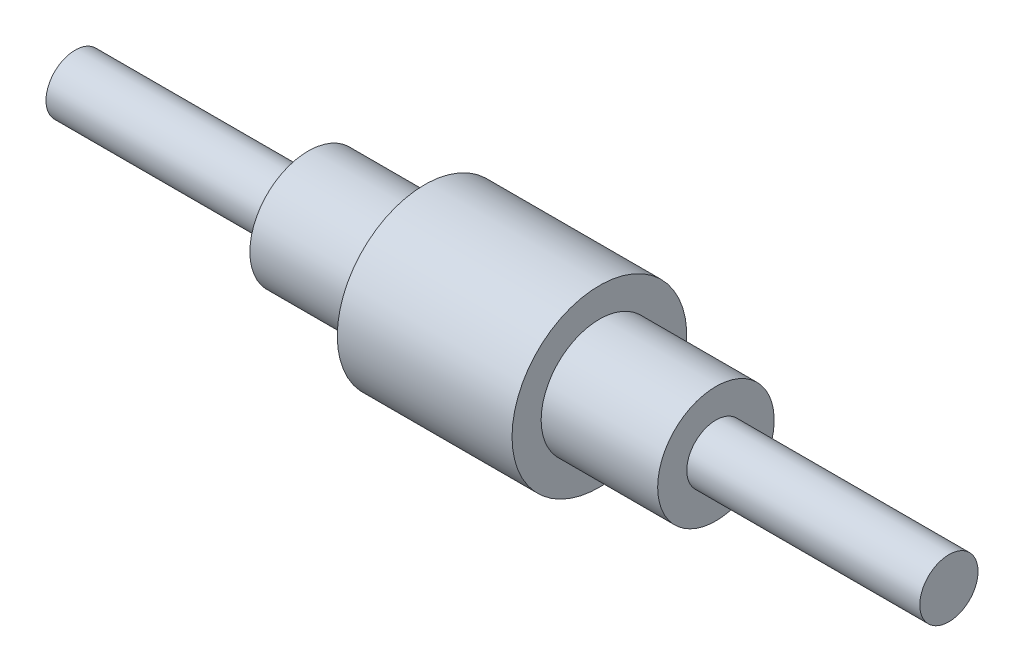
ISO-10303-21;
HEADER;
FILE_DESCRIPTION(('STEP AP214'),'2;1');
FILE_NAME('part.step','',(''),(''),'','','');
FILE_SCHEMA(('AUTOMOTIVE_DESIGN { 1 0 10303 214 1 1 1 1 }'));
ENDSEC;
DATA;
#1=APPLICATION_CONTEXT('core data for automotive mechanical design processes');
#2=APPLICATION_PROTOCOL_DEFINITION('international standard','automotive_design',2000,#1);
#3=PRODUCT_CONTEXT('',#1,'mechanical');
#4=PRODUCT('Part','Part','',(#3));
#5=PRODUCT_RELATED_PRODUCT_CATEGORY('part','',(#4));
#6=PRODUCT_DEFINITION_FORMATION('','',#4);
#7=PRODUCT_DEFINITION_CONTEXT('part definition',#1,'design');
#8=PRODUCT_DEFINITION('design','',#6,#7);
#9=PRODUCT_DEFINITION_SHAPE('','',#8);
#10=(LENGTH_UNIT() NAMED_UNIT(*) SI_UNIT(.MILLI.,.METRE.));
#11=(NAMED_UNIT(*) PLANE_ANGLE_UNIT() SI_UNIT($,.RADIAN.));
#12=(NAMED_UNIT(*) SI_UNIT($,.STERADIAN.) SOLID_ANGLE_UNIT());
#13=UNCERTAINTY_MEASURE_WITH_UNIT(LENGTH_MEASURE(1.E-05),#10,'distance_accuracy_value','');
#14=(GEOMETRIC_REPRESENTATION_CONTEXT(3) GLOBAL_UNCERTAINTY_ASSIGNED_CONTEXT((#13)) GLOBAL_UNIT_ASSIGNED_CONTEXT((#10,
#11,#12)) REPRESENTATION_CONTEXT('',''));
#15=CARTESIAN_POINT('',(0.,0.,0.));
#16=DIRECTION('',(0.,0.,1.));
#17=DIRECTION('',(1.,0.,0.));
#18=AXIS2_PLACEMENT_3D('',#15,#16,#17);
#19=CARTESIAN_POINT('',(0.,0.,0.));
#20=DIRECTION('',(-1.,0.,0.));
#21=DIRECTION('',(0.,0.,1.));
#22=AXIS2_PLACEMENT_3D('',#19,#20,#21);
#23=PLANE('',#22);
#24=CARTESIAN_POINT('',(0.,0.,0.));
#25=DIRECTION('',(-1.,0.,0.));
#26=DIRECTION('',(0.,0.,1.));
#27=AXIS2_PLACEMENT_3D('',#24,#25,#26);
#28=CIRCLE('',#27,10.);
#29=CARTESIAN_POINT('',(0.,0.,10.));
#30=VERTEX_POINT('',#29);
#31=EDGE_CURVE('E10',#30,#30,#28,.T.);
#32=ORIENTED_EDGE('',*,*,#31,.T.);
#33=EDGE_LOOP('',(#32));
#34=FACE_BOUND('',#33,.T.);
#35=ADVANCED_FACE('F31',(#34),#23,.T.);
#36=CARTESIAN_POINT('',(0.,0.,0.));
#37=DIRECTION('',(-1.,0.,0.));
#38=DIRECTION('',(0.,0.,1.));
#39=AXIS2_PLACEMENT_3D('',#36,#37,#38);
#40=CYLINDRICAL_SURFACE('',#39,10.);
#41=CARTESIAN_POINT('',(80.,0.,0.));
#42=DIRECTION('',(-1.,0.,0.));
#43=DIRECTION('',(0.,0.,1.));
#44=AXIS2_PLACEMENT_3D('',#41,#42,#43);
#45=CIRCLE('',#44,10.);
#46=CARTESIAN_POINT('',(80.,0.,10.));
#47=VERTEX_POINT('',#46);
#48=EDGE_CURVE('E37',#47,#47,#45,.T.);
#49=ORIENTED_EDGE('',*,*,#48,.T.);
#50=EDGE_LOOP('',(#49));
#51=FACE_BOUND('',#50,.T.);
#52=ORIENTED_EDGE('',*,*,#31,.F.);
#53=EDGE_LOOP('',(#52));
#54=FACE_BOUND('',#53,.T.);
#55=ADVANCED_FACE('F81',(#51,#54),#40,.T.);
#56=CARTESIAN_POINT('',(80.,-10.,0.));
#57=DIRECTION('',(-1.,0.,0.));
#58=DIRECTION('',(0.,0.,1.));
#59=AXIS2_PLACEMENT_3D('',#56,#57,#58);
#60=PLANE('',#59);
#61=CARTESIAN_POINT('',(80.,0.,0.));
#62=DIRECTION('',(-1.,0.,0.));
#63=DIRECTION('',(0.,0.,1.));
#64=AXIS2_PLACEMENT_3D('',#61,#62,#63);
#65=CIRCLE('',#64,20.);
#66=CARTESIAN_POINT('',(80.,0.,20.));
#67=VERTEX_POINT('',#66);
#68=EDGE_CURVE('E41',#67,#67,#65,.T.);
#69=ORIENTED_EDGE('',*,*,#68,.T.);
#70=EDGE_LOOP('',(#69));
#71=FACE_BOUND('',#70,.T.);
#72=ORIENTED_EDGE('',*,*,#48,.F.);
#73=EDGE_LOOP('',(#72));
#74=FACE_BOUND('',#73,.T.);
#75=ADVANCED_FACE('F85',(#71,#74),#60,.T.);
#76=CARTESIAN_POINT('',(0.,0.,0.));
#77=DIRECTION('',(-1.,0.,0.));
#78=DIRECTION('',(0.,0.,1.));
#79=AXIS2_PLACEMENT_3D('',#76,#77,#78);
#80=CYLINDRICAL_SURFACE('',#79,20.);
#81=CARTESIAN_POINT('',(120.,0.,0.));
#82=DIRECTION('',(-1.,0.,0.));
#83=DIRECTION('',(0.,0.,1.));
#84=AXIS2_PLACEMENT_3D('',#81,#82,#83);
#85=CIRCLE('',#84,20.);
#86=CARTESIAN_POINT('',(120.,0.,20.));
#87=VERTEX_POINT('',#86);
#88=EDGE_CURVE('E45',#87,#87,#85,.T.);
#89=ORIENTED_EDGE('',*,*,#88,.T.);
#90=EDGE_LOOP('',(#89));
#91=FACE_BOUND('',#90,.T.);
#92=ORIENTED_EDGE('',*,*,#68,.F.);
#93=EDGE_LOOP('',(#92));
#94=FACE_BOUND('',#93,.T.);
#95=ADVANCED_FACE('F89',(#91,#94),#80,.T.);
#96=CARTESIAN_POINT('',(120.,-20.,0.));
#97=DIRECTION('',(-1.,0.,0.));
#98=DIRECTION('',(0.,0.,1.));
#99=AXIS2_PLACEMENT_3D('',#96,#97,#98);
#100=PLANE('',#99);
#101=CARTESIAN_POINT('',(120.,0.,0.));
#102=DIRECTION('',(-1.,0.,0.));
#103=DIRECTION('',(0.,0.,1.));
#104=AXIS2_PLACEMENT_3D('',#101,#102,#103);
#105=CIRCLE('',#104,30.);
#106=CARTESIAN_POINT('',(120.,0.,30.));
#107=VERTEX_POINT('',#106);
#108=EDGE_CURVE('E50',#107,#107,#105,.T.);
#109=ORIENTED_EDGE('',*,*,#108,.T.);
#110=EDGE_LOOP('',(#109));
#111=FACE_BOUND('',#110,.T.);
#112=ORIENTED_EDGE('',*,*,#88,.F.);
#113=EDGE_LOOP('',(#112));
#114=FACE_BOUND('',#113,.T.);
#115=ADVANCED_FACE('F96',(#111,#114),#100,.T.);
#116=CARTESIAN_POINT('',(0.,0.,0.));
#117=DIRECTION('',(-1.,0.,0.));
#118=DIRECTION('',(0.,0.,1.));
#119=AXIS2_PLACEMENT_3D('',#116,#117,#118);
#120=CYLINDRICAL_SURFACE('',#119,30.);
#121=CARTESIAN_POINT('',(180.,0.,0.));
#122=DIRECTION('',(-1.,0.,0.));
#123=DIRECTION('',(0.,0.,1.));
#124=AXIS2_PLACEMENT_3D('',#121,#122,#123);
#125=CIRCLE('',#124,30.);
#126=CARTESIAN_POINT('',(180.,0.,30.));
#127=VERTEX_POINT('',#126);
#128=EDGE_CURVE('E53',#127,#127,#125,.T.);
#129=ORIENTED_EDGE('',*,*,#128,.T.);
#130=EDGE_LOOP('',(#129));
#131=FACE_BOUND('',#130,.T.);
#132=ORIENTED_EDGE('',*,*,#108,.F.);
#133=EDGE_LOOP('',(#132));
#134=FACE_BOUND('',#133,.T.);
#135=ADVANCED_FACE('F100',(#131,#134),#120,.T.);
#136=CARTESIAN_POINT('',(180.,-30.,0.));
#137=DIRECTION('',(1.,0.,0.));
#138=DIRECTION('',(0.,0.,-1.));
#139=AXIS2_PLACEMENT_3D('',#136,#137,#138);
#140=PLANE('',#139);
#141=CARTESIAN_POINT('',(180.,0.,0.));
#142=DIRECTION('',(-1.,0.,0.));
#143=DIRECTION('',(0.,0.,1.));
#144=AXIS2_PLACEMENT_3D('',#141,#142,#143);
#145=CIRCLE('',#144,20.);
#146=CARTESIAN_POINT('',(180.,0.,20.));
#147=VERTEX_POINT('',#146);
#148=EDGE_CURVE('E56',#147,#147,#145,.T.);
#149=ORIENTED_EDGE('',*,*,#148,.T.);
#150=EDGE_LOOP('',(#149));
#151=FACE_BOUND('',#150,.T.);
#152=ORIENTED_EDGE('',*,*,#128,.F.);
#153=EDGE_LOOP('',(#152));
#154=FACE_BOUND('',#153,.T.);
#155=ADVANCED_FACE('F104',(#151,#154),#140,.T.);
#156=CARTESIAN_POINT('',(0.,0.,0.));
#157=DIRECTION('',(-1.,0.,0.));
#158=DIRECTION('',(0.,0.,1.));
#159=AXIS2_PLACEMENT_3D('',#156,#157,#158);
#160=CYLINDRICAL_SURFACE('',#159,20.);
#161=CARTESIAN_POINT('',(220.,0.,0.));
#162=DIRECTION('',(-1.,0.,0.));
#163=DIRECTION('',(0.,0.,1.));
#164=AXIS2_PLACEMENT_3D('',#161,#162,#163);
#165=CIRCLE('',#164,20.);
#166=CARTESIAN_POINT('',(220.,0.,20.));
#167=VERTEX_POINT('',#166);
#168=EDGE_CURVE('E59',#167,#167,#165,.T.);
#169=ORIENTED_EDGE('',*,*,#168,.T.);
#170=EDGE_LOOP('',(#169));
#171=FACE_BOUND('',#170,.T.);
#172=ORIENTED_EDGE('',*,*,#148,.F.);
#173=EDGE_LOOP('',(#172));
#174=FACE_BOUND('',#173,.T.);
#175=ADVANCED_FACE('F108',(#171,#174),#160,.T.);
#176=CARTESIAN_POINT('',(220.,-20.,0.));
#177=DIRECTION('',(1.,0.,0.));
#178=DIRECTION('',(0.,0.,-1.));
#179=AXIS2_PLACEMENT_3D('',#176,#177,#178);
#180=PLANE('',#179);
#181=CARTESIAN_POINT('',(220.,0.,0.));
#182=DIRECTION('',(-1.,0.,0.));
#183=DIRECTION('',(0.,0.,1.));
#184=AXIS2_PLACEMENT_3D('',#181,#182,#183);
#185=CIRCLE('',#184,10.);
#186=CARTESIAN_POINT('',(220.,0.,10.));
#187=VERTEX_POINT('',#186);
#188=EDGE_CURVE('E62',#187,#187,#185,.T.);
#189=ORIENTED_EDGE('',*,*,#188,.T.);
#190=EDGE_LOOP('',(#189));
#191=FACE_BOUND('',#190,.T.);
#192=ORIENTED_EDGE('',*,*,#168,.F.);
#193=EDGE_LOOP('',(#192));
#194=FACE_BOUND('',#193,.T.);
#195=ADVANCED_FACE('F78',(#191,#194),#180,.T.);
#196=CARTESIAN_POINT('',(0.,0.,0.));
#197=DIRECTION('',(-1.,0.,0.));
#198=DIRECTION('',(0.,0.,1.));
#199=AXIS2_PLACEMENT_3D('',#196,#197,#198);
#200=CYLINDRICAL_SURFACE('',#199,10.);
#201=CARTESIAN_POINT('',(300.,0.,0.));
#202=DIRECTION('',(-1.,0.,0.));
#203=DIRECTION('',(0.,0.,1.));
#204=AXIS2_PLACEMENT_3D('',#201,#202,#203);
#205=CIRCLE('',#204,10.);
#206=CARTESIAN_POINT('',(300.,0.,10.));
#207=VERTEX_POINT('',#206);
#208=EDGE_CURVE('E65',#207,#207,#205,.T.);
#209=ORIENTED_EDGE('',*,*,#208,.T.);
#210=EDGE_LOOP('',(#209));
#211=FACE_BOUND('',#210,.T.);
#212=ORIENTED_EDGE('',*,*,#188,.F.);
#213=EDGE_LOOP('',(#212));
#214=FACE_BOUND('',#213,.T.);
#215=ADVANCED_FACE('F69',(#211,#214),#200,.T.);
#216=CARTESIAN_POINT('',(300.,-10.,0.));
#217=DIRECTION('',(1.,0.,0.));
#218=DIRECTION('',(0.,0.,-1.));
#219=AXIS2_PLACEMENT_3D('',#216,#217,#218);
#220=PLANE('',#219);
#221=ORIENTED_EDGE('',*,*,#208,.F.);
#222=EDGE_LOOP('',(#221));
#223=FACE_BOUND('',#222,.T.);
#224=ADVANCED_FACE('F72',(#223),#220,.T.);
#225=CLOSED_SHELL('',(#35,#55,#75,#95,#115,#135,#155,#175,#195,#215,#224));
#226=MANIFOLD_SOLID_BREP('B2',#225);
#227=ADVANCED_BREP_SHAPE_REPRESENTATION('',(#18,#226),#14);
#228=SHAPE_DEFINITION_REPRESENTATION(#9,#227);
ENDSEC;
END-ISO-10303-21;
